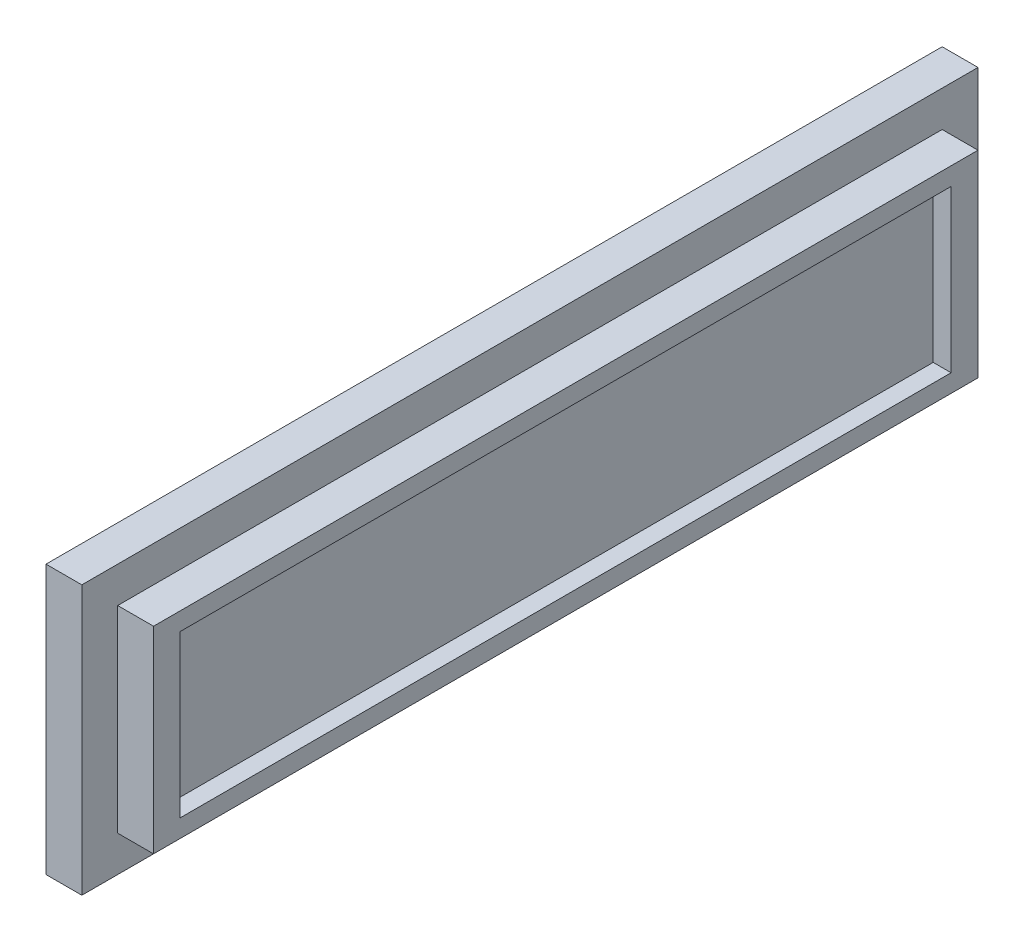
ISO-10303-21;
HEADER;
FILE_DESCRIPTION(('STEP AP214'),'2;1');
FILE_NAME('part.step','',(''),(''),'','','');
FILE_SCHEMA(('AUTOMOTIVE_DESIGN { 1 0 10303 214 1 1 1 1 }'));
ENDSEC;
DATA;
#1=APPLICATION_CONTEXT('core data for automotive mechanical design processes');
#2=APPLICATION_PROTOCOL_DEFINITION('international standard','automotive_design',2000,#1);
#3=PRODUCT_CONTEXT('',#1,'mechanical');
#4=PRODUCT('Part','Part','',(#3));
#5=PRODUCT_RELATED_PRODUCT_CATEGORY('part','',(#4));
#6=PRODUCT_DEFINITION_FORMATION('','',#4);
#7=PRODUCT_DEFINITION_CONTEXT('part definition',#1,'design');
#8=PRODUCT_DEFINITION('design','',#6,#7);
#9=PRODUCT_DEFINITION_SHAPE('','',#8);
#10=(LENGTH_UNIT() NAMED_UNIT(*) SI_UNIT(.MILLI.,.METRE.));
#11=(NAMED_UNIT(*) PLANE_ANGLE_UNIT() SI_UNIT($,.RADIAN.));
#12=(NAMED_UNIT(*) SI_UNIT($,.STERADIAN.) SOLID_ANGLE_UNIT());
#13=UNCERTAINTY_MEASURE_WITH_UNIT(LENGTH_MEASURE(1.E-05),#10,'distance_accuracy_value','');
#14=(GEOMETRIC_REPRESENTATION_CONTEXT(3) GLOBAL_UNCERTAINTY_ASSIGNED_CONTEXT((#13)) GLOBAL_UNIT_ASSIGNED_CONTEXT((#10,
#11,#12)) REPRESENTATION_CONTEXT('',''));
#15=CARTESIAN_POINT('',(0.,0.,0.));
#16=DIRECTION('',(0.,0.,1.));
#17=DIRECTION('',(1.,0.,0.));
#18=AXIS2_PLACEMENT_3D('',#15,#16,#17);
#19=CARTESIAN_POINT('',(2.,4.01459854014599,28.9233576642336));
#20=DIRECTION('',(0.,0.,-1.));
#21=DIRECTION('',(-1.,0.,0.));
#22=AXIS2_PLACEMENT_3D('',#19,#20,#21);
#23=PLANE('',#22);
#24=DIRECTION('',(0.,-1.,0.));
#25=VECTOR('',#24,1.);
#26=CARTESIAN_POINT('',(0.,4.01459854014599,28.9233576642336));
#27=LINE('',#26,#25);
#28=CARTESIAN_POINT('',(0.,4.01459854014599,28.9233576642336));
#29=VERTEX_POINT('',#28);
#30=CARTESIAN_POINT('',(0.,-10.985401459854,28.9233576642336));
#31=VERTEX_POINT('',#30);
#32=EDGE_CURVE('E220',#29,#31,#27,.T.);
#33=ORIENTED_EDGE('',*,*,#32,.T.);
#34=DIRECTION('',(-1.,0.,0.));
#35=VECTOR('',#34,1.);
#36=CARTESIAN_POINT('',(2.,-10.985401459854,28.9233576642336));
#37=LINE('',#36,#35);
#38=CARTESIAN_POINT('',(2.,-10.985401459854,28.9233576642336));
#39=VERTEX_POINT('',#38);
#40=EDGE_CURVE('E11',#39,#31,#37,.T.);
#41=ORIENTED_EDGE('',*,*,#40,.F.);
#42=DIRECTION('',(0.,-1.,0.));
#43=VECTOR('',#42,1.);
#44=CARTESIAN_POINT('',(2.,4.01459854014599,28.9233576642336));
#45=LINE('',#44,#43);
#46=CARTESIAN_POINT('',(2.,4.01459854014599,28.9233576642336));
#47=VERTEX_POINT('',#46);
#48=EDGE_CURVE('E221',#47,#39,#45,.T.);
#49=ORIENTED_EDGE('',*,*,#48,.F.);
#50=DIRECTION('',(-1.,0.,0.));
#51=VECTOR('',#50,1.);
#52=CARTESIAN_POINT('',(2.,4.01459854014599,28.9233576642336));
#53=LINE('',#52,#51);
#54=EDGE_CURVE('E235',#47,#29,#53,.T.);
#55=ORIENTED_EDGE('',*,*,#54,.T.);
#56=EDGE_LOOP('',(#33,#41,#49,#55));
#57=FACE_BOUND('',#56,.T.);
#58=ADVANCED_FACE('F39',(#57),#23,.F.);
#59=CARTESIAN_POINT('',(2.,-10.985401459854,28.9233576642336));
#60=DIRECTION('',(0.,1.,0.));
#61=DIRECTION('',(0.,0.,1.));
#62=AXIS2_PLACEMENT_3D('',#59,#60,#61);
#63=PLANE('',#62);
#64=DIRECTION('',(0.,0.,-1.));
#65=VECTOR('',#64,1.);
#66=CARTESIAN_POINT('',(0.,-10.985401459854,28.9233576642336));
#67=LINE('',#66,#65);
#68=CARTESIAN_POINT('',(0.,-10.985401459854,-21.0766423357664));
#69=VERTEX_POINT('',#68);
#70=EDGE_CURVE('E239',#31,#69,#67,.T.);
#71=ORIENTED_EDGE('',*,*,#70,.T.);
#72=DIRECTION('',(-1.,0.,0.));
#73=VECTOR('',#72,1.);
#74=CARTESIAN_POINT('',(2.,-10.985401459854,-21.0766423357664));
#75=LINE('',#74,#73);
#76=CARTESIAN_POINT('',(2.,-10.985401459854,-21.0766423357664));
#77=VERTEX_POINT('',#76);
#78=EDGE_CURVE('E47',#77,#69,#75,.T.);
#79=ORIENTED_EDGE('',*,*,#78,.F.);
#80=DIRECTION('',(0.,0.,-1.));
#81=VECTOR('',#80,1.);
#82=CARTESIAN_POINT('',(2.,-10.985401459854,28.9233576642336));
#83=LINE('',#82,#81);
#84=EDGE_CURVE('E225',#39,#77,#83,.T.);
#85=ORIENTED_EDGE('',*,*,#84,.F.);
#86=ORIENTED_EDGE('',*,*,#40,.T.);
#87=EDGE_LOOP('',(#71,#79,#85,#86));
#88=FACE_BOUND('',#87,.T.);
#89=ADVANCED_FACE('F275',(#88),#63,.F.);
#90=CARTESIAN_POINT('',(2.,4.01459854014599,-21.0766423357664));
#91=DIRECTION('',(0.,0.,1.));
#92=DIRECTION('',(1.,0.,0.));
#93=AXIS2_PLACEMENT_3D('',#90,#91,#92);
#94=PLANE('',#93);
#95=DIRECTION('',(0.,1.,0.));
#96=VECTOR('',#95,1.);
#97=CARTESIAN_POINT('',(0.,4.01459854014599,-21.0766423357664));
#98=LINE('',#97,#96);
#99=CARTESIAN_POINT('',(0.,4.01459854014599,-21.0766423357664));
#100=VERTEX_POINT('',#99);
#101=EDGE_CURVE('E242',#69,#100,#98,.T.);
#102=ORIENTED_EDGE('',*,*,#101,.T.);
#103=DIRECTION('',(-1.,0.,0.));
#104=VECTOR('',#103,1.);
#105=CARTESIAN_POINT('',(2.,4.01459854014599,-21.0766423357664));
#106=LINE('',#105,#104);
#107=CARTESIAN_POINT('',(2.,4.01459854014599,-21.0766423357664));
#108=VERTEX_POINT('',#107);
#109=EDGE_CURVE('E250',#108,#100,#106,.T.);
#110=ORIENTED_EDGE('',*,*,#109,.F.);
#111=DIRECTION('',(0.,1.,0.));
#112=VECTOR('',#111,1.);
#113=CARTESIAN_POINT('',(2.,4.01459854014599,-21.0766423357664));
#114=LINE('',#113,#112);
#115=EDGE_CURVE('E229',#77,#108,#114,.T.);
#116=ORIENTED_EDGE('',*,*,#115,.F.);
#117=ORIENTED_EDGE('',*,*,#78,.T.);
#118=EDGE_LOOP('',(#102,#110,#116,#117));
#119=FACE_BOUND('',#118,.T.);
#120=ADVANCED_FACE('F259',(#119),#94,.F.);
#121=CARTESIAN_POINT('',(2.,4.01459854014599,28.9233576642336));
#122=DIRECTION('',(0.,-1.,0.));
#123=DIRECTION('',(0.,0.,-1.));
#124=AXIS2_PLACEMENT_3D('',#121,#122,#123);
#125=PLANE('',#124);
#126=DIRECTION('',(0.,0.,1.));
#127=VECTOR('',#126,1.);
#128=CARTESIAN_POINT('',(0.,4.01459854014599,28.9233576642336));
#129=LINE('',#128,#127);
#130=EDGE_CURVE('E226',#100,#29,#129,.T.);
#131=ORIENTED_EDGE('',*,*,#130,.T.);
#132=ORIENTED_EDGE('',*,*,#54,.F.);
#133=DIRECTION('',(0.,0.,1.));
#134=VECTOR('',#133,1.);
#135=CARTESIAN_POINT('',(2.,4.01459854014599,28.9233576642336));
#136=LINE('',#135,#134);
#137=EDGE_CURVE('E232',#108,#47,#136,.T.);
#138=ORIENTED_EDGE('',*,*,#137,.F.);
#139=ORIENTED_EDGE('',*,*,#109,.T.);
#140=EDGE_LOOP('',(#131,#132,#138,#139));
#141=FACE_BOUND('',#140,.T.);
#142=ADVANCED_FACE('F268',(#141),#125,.F.);
#143=CARTESIAN_POINT('',(2.,0.,0.));
#144=DIRECTION('',(1.,0.,0.));
#145=DIRECTION('',(0.,0.,-1.));
#146=AXIS2_PLACEMENT_3D('',#143,#144,#145);
#147=PLANE('',#146);
#148=DIRECTION('',(0.,-1.,0.));
#149=VECTOR('',#148,1.);
#150=CARTESIAN_POINT('',(2.,2.01459854014599,26.9233576642336));
#151=LINE('',#150,#149);
#152=CARTESIAN_POINT('',(2.,2.01459854014599,26.9233576642336));
#153=VERTEX_POINT('',#152);
#154=CARTESIAN_POINT('',(2.,-8.98540145985401,26.9233576642336));
#155=VERTEX_POINT('',#154);
#156=EDGE_CURVE('E62',#153,#155,#151,.T.);
#157=ORIENTED_EDGE('',*,*,#156,.F.);
#158=DIRECTION('',(0.,0.,1.));
#159=VECTOR('',#158,1.);
#160=CARTESIAN_POINT('',(2.,2.01459854014599,26.9233576642336));
#161=LINE('',#160,#159);
#162=CARTESIAN_POINT('',(2.,2.01459854014599,-19.0766423357664));
#163=VERTEX_POINT('',#162);
#164=EDGE_CURVE('E183',#163,#153,#161,.T.);
#165=ORIENTED_EDGE('',*,*,#164,.F.);
#166=DIRECTION('',(0.,1.,0.));
#167=VECTOR('',#166,1.);
#168=CARTESIAN_POINT('',(2.,2.01459854014599,-19.0766423357664));
#169=LINE('',#168,#167);
#170=CARTESIAN_POINT('',(2.,-8.98540145985401,-19.0766423357664));
#171=VERTEX_POINT('',#170);
#172=EDGE_CURVE('E199',#171,#163,#169,.T.);
#173=ORIENTED_EDGE('',*,*,#172,.F.);
#174=DIRECTION('',(0.,0.,-1.));
#175=VECTOR('',#174,1.);
#176=CARTESIAN_POINT('',(2.,-8.98540145985401,26.9233576642336));
#177=LINE('',#176,#175);
#178=EDGE_CURVE('E195',#155,#171,#177,.T.);
#179=ORIENTED_EDGE('',*,*,#178,.F.);
#180=EDGE_LOOP('',(#157,#165,#173,#179));
#181=FACE_BOUND('',#180,.T.);
#182=ORIENTED_EDGE('',*,*,#48,.T.);
#183=ORIENTED_EDGE('',*,*,#84,.T.);
#184=ORIENTED_EDGE('',*,*,#115,.T.);
#185=ORIENTED_EDGE('',*,*,#137,.T.);
#186=EDGE_LOOP('',(#182,#183,#184,#185));
#187=FACE_BOUND('',#186,.T.);
#188=ADVANCED_FACE('F274',(#181,#187),#147,.T.);
#189=CARTESIAN_POINT('',(0.,0.,0.));
#190=DIRECTION('',(1.,0.,0.));
#191=DIRECTION('',(0.,0.,-1.));
#192=AXIS2_PLACEMENT_3D('',#189,#190,#191);
#193=PLANE('',#192);
#194=ORIENTED_EDGE('',*,*,#32,.F.);
#195=ORIENTED_EDGE('',*,*,#130,.F.);
#196=ORIENTED_EDGE('',*,*,#101,.F.);
#197=ORIENTED_EDGE('',*,*,#70,.F.);
#198=EDGE_LOOP('',(#194,#195,#196,#197));
#199=FACE_BOUND('',#198,.T.);
#200=ADVANCED_FACE('F265',(#199),#193,.F.);
#201=CARTESIAN_POINT('',(4.,2.01459854014599,26.9233576642336));
#202=DIRECTION('',(0.,0.,-1.));
#203=DIRECTION('',(-1.,0.,0.));
#204=AXIS2_PLACEMENT_3D('',#201,#202,#203);
#205=PLANE('',#204);
#206=ORIENTED_EDGE('',*,*,#156,.T.);
#207=DIRECTION('',(-1.,0.,0.));
#208=VECTOR('',#207,1.);
#209=CARTESIAN_POINT('',(4.,-8.98540145985401,26.9233576642336));
#210=LINE('',#209,#208);
#211=CARTESIAN_POINT('',(4.,-8.98540145985401,26.9233576642336));
#212=VERTEX_POINT('',#211);
#213=EDGE_CURVE('E216',#212,#155,#210,.T.);
#214=ORIENTED_EDGE('',*,*,#213,.F.);
#215=DIRECTION('',(0.,-1.,0.));
#216=VECTOR('',#215,1.);
#217=CARTESIAN_POINT('',(4.,2.01459854014599,26.9233576642336));
#218=LINE('',#217,#216);
#219=CARTESIAN_POINT('',(4.,2.01459854014599,26.9233576642336));
#220=VERTEX_POINT('',#219);
#221=EDGE_CURVE('E178',#220,#212,#218,.T.);
#222=ORIENTED_EDGE('',*,*,#221,.F.);
#223=DIRECTION('',(-1.,0.,0.));
#224=VECTOR('',#223,1.);
#225=CARTESIAN_POINT('',(4.,2.01459854014599,26.9233576642336));
#226=LINE('',#225,#224);
#227=EDGE_CURVE('E192',#220,#153,#226,.T.);
#228=ORIENTED_EDGE('',*,*,#227,.T.);
#229=EDGE_LOOP('',(#206,#214,#222,#228));
#230=FACE_BOUND('',#229,.T.);
#231=ADVANCED_FACE('F287',(#230),#205,.F.);
#232=CARTESIAN_POINT('',(4.,-8.98540145985401,26.9233576642336));
#233=DIRECTION('',(0.,1.,0.));
#234=DIRECTION('',(0.,0.,1.));
#235=AXIS2_PLACEMENT_3D('',#232,#233,#234);
#236=PLANE('',#235);
#237=ORIENTED_EDGE('',*,*,#178,.T.);
#238=DIRECTION('',(-1.,0.,0.));
#239=VECTOR('',#238,1.);
#240=CARTESIAN_POINT('',(4.,-8.98540145985401,-19.0766423357664));
#241=LINE('',#240,#239);
#242=CARTESIAN_POINT('',(4.,-8.98540145985401,-19.0766423357664));
#243=VERTEX_POINT('',#242);
#244=EDGE_CURVE('E212',#243,#171,#241,.T.);
#245=ORIENTED_EDGE('',*,*,#244,.F.);
#246=DIRECTION('',(0.,0.,-1.));
#247=VECTOR('',#246,1.);
#248=CARTESIAN_POINT('',(4.,-8.98540145985401,26.9233576642336));
#249=LINE('',#248,#247);
#250=EDGE_CURVE('E182',#212,#243,#249,.T.);
#251=ORIENTED_EDGE('',*,*,#250,.F.);
#252=ORIENTED_EDGE('',*,*,#213,.T.);
#253=EDGE_LOOP('',(#237,#245,#251,#252));
#254=FACE_BOUND('',#253,.T.);
#255=ADVANCED_FACE('F292',(#254),#236,.F.);
#256=CARTESIAN_POINT('',(4.,2.01459854014599,-19.0766423357664));
#257=DIRECTION('',(0.,0.,1.));
#258=DIRECTION('',(1.,0.,0.));
#259=AXIS2_PLACEMENT_3D('',#256,#257,#258);
#260=PLANE('',#259);
#261=ORIENTED_EDGE('',*,*,#172,.T.);
#262=DIRECTION('',(-1.,0.,0.));
#263=VECTOR('',#262,1.);
#264=CARTESIAN_POINT('',(4.,2.01459854014599,-19.0766423357664));
#265=LINE('',#264,#263);
#266=CARTESIAN_POINT('',(4.,2.01459854014599,-19.0766423357664));
#267=VERTEX_POINT('',#266);
#268=EDGE_CURVE('E208',#267,#163,#265,.T.);
#269=ORIENTED_EDGE('',*,*,#268,.F.);
#270=DIRECTION('',(0.,1.,0.));
#271=VECTOR('',#270,1.);
#272=CARTESIAN_POINT('',(4.,2.01459854014599,-19.0766423357664));
#273=LINE('',#272,#271);
#274=EDGE_CURVE('E186',#243,#267,#273,.T.);
#275=ORIENTED_EDGE('',*,*,#274,.F.);
#276=ORIENTED_EDGE('',*,*,#244,.T.);
#277=EDGE_LOOP('',(#261,#269,#275,#276));
#278=FACE_BOUND('',#277,.T.);
#279=ADVANCED_FACE('F296',(#278),#260,.F.);
#280=CARTESIAN_POINT('',(4.,2.01459854014599,26.9233576642336));
#281=DIRECTION('',(0.,-1.,0.));
#282=DIRECTION('',(0.,0.,-1.));
#283=AXIS2_PLACEMENT_3D('',#280,#281,#282);
#284=PLANE('',#283);
#285=ORIENTED_EDGE('',*,*,#164,.T.);
#286=ORIENTED_EDGE('',*,*,#227,.F.);
#287=DIRECTION('',(0.,0.,1.));
#288=VECTOR('',#287,1.);
#289=CARTESIAN_POINT('',(4.,2.01459854014599,26.9233576642336));
#290=LINE('',#289,#288);
#291=EDGE_CURVE('E189',#267,#220,#290,.T.);
#292=ORIENTED_EDGE('',*,*,#291,.F.);
#293=ORIENTED_EDGE('',*,*,#268,.T.);
#294=EDGE_LOOP('',(#285,#286,#292,#293));
#295=FACE_BOUND('',#294,.T.);
#296=ADVANCED_FACE('F300',(#295),#284,.F.);
#297=CARTESIAN_POINT('',(4.,0.,0.));
#298=DIRECTION('',(1.,0.,0.));
#299=DIRECTION('',(0.,0.,-1.));
#300=AXIS2_PLACEMENT_3D('',#297,#298,#299);
#301=PLANE('',#300);
#302=DIRECTION('',(0.,-1.,0.));
#303=VECTOR('',#302,1.);
#304=CARTESIAN_POINT('',(4.,1.01459854014599,25.4330156481183));
#305=LINE('',#304,#303);
#306=CARTESIAN_POINT('',(4.,1.01459854014599,25.4330156481183));
#307=VERTEX_POINT('',#306);
#308=CARTESIAN_POINT('',(4.,-7.98813042960639,25.4330156481183));
#309=VERTEX_POINT('',#308);
#310=EDGE_CURVE('E54',#307,#309,#305,.T.);
#311=ORIENTED_EDGE('',*,*,#310,.F.);
#312=DIRECTION('',(0.,0.,1.));
#313=VECTOR('',#312,1.);
#314=CARTESIAN_POINT('',(4.,1.01459854014599,25.4330156481183));
#315=LINE('',#314,#313);
#316=CARTESIAN_POINT('',(4.,1.01459854014599,-17.5766423357664));
#317=VERTEX_POINT('',#316);
#318=EDGE_CURVE('E151',#317,#307,#315,.T.);
#319=ORIENTED_EDGE('',*,*,#318,.F.);
#320=DIRECTION('',(0.,1.,0.));
#321=VECTOR('',#320,1.);
#322=CARTESIAN_POINT('',(4.,1.01459854014599,-17.5766423357664));
#323=LINE('',#322,#321);
#324=CARTESIAN_POINT('',(4.,-7.98813042960639,-17.5766423357664));
#325=VERTEX_POINT('',#324);
#326=EDGE_CURVE('E155',#325,#317,#323,.T.);
#327=ORIENTED_EDGE('',*,*,#326,.F.);
#328=DIRECTION('',(0.,0.,-1.));
#329=VECTOR('',#328,1.);
#330=CARTESIAN_POINT('',(4.,-7.98813042960639,25.4330156481183));
#331=LINE('',#330,#329);
#332=EDGE_CURVE('E164',#309,#325,#331,.T.);
#333=ORIENTED_EDGE('',*,*,#332,.F.);
#334=EDGE_LOOP('',(#311,#319,#327,#333));
#335=FACE_BOUND('',#334,.T.);
#336=ORIENTED_EDGE('',*,*,#221,.T.);
#337=ORIENTED_EDGE('',*,*,#250,.T.);
#338=ORIENTED_EDGE('',*,*,#274,.T.);
#339=ORIENTED_EDGE('',*,*,#291,.T.);
#340=EDGE_LOOP('',(#336,#337,#338,#339));
#341=FACE_BOUND('',#340,.T.);
#342=ADVANCED_FACE('F304',(#335,#341),#301,.T.);
#343=CARTESIAN_POINT('',(3.,1.01459854014599,25.4330156481183));
#344=DIRECTION('',(0.,0.,1.));
#345=DIRECTION('',(1.,0.,0.));
#346=AXIS2_PLACEMENT_3D('',#343,#344,#345);
#347=PLANE('',#346);
#348=ORIENTED_EDGE('',*,*,#310,.T.);
#349=DIRECTION('',(1.,0.,0.));
#350=VECTOR('',#349,1.);
#351=CARTESIAN_POINT('',(3.,-7.98813042960639,25.4330156481183));
#352=LINE('',#351,#350);
#353=CARTESIAN_POINT('',(3.,-7.98813042960639,25.4330156481183));
#354=VERTEX_POINT('',#353);
#355=EDGE_CURVE('E126',#354,#309,#352,.T.);
#356=ORIENTED_EDGE('',*,*,#355,.F.);
#357=DIRECTION('',(0.,-1.,0.));
#358=VECTOR('',#357,1.);
#359=CARTESIAN_POINT('',(3.,1.01459854014599,25.4330156481183));
#360=LINE('',#359,#358);
#361=CARTESIAN_POINT('',(3.,1.01459854014599,25.4330156481183));
#362=VERTEX_POINT('',#361);
#363=EDGE_CURVE('E130',#362,#354,#360,.T.);
#364=ORIENTED_EDGE('',*,*,#363,.F.);
#365=DIRECTION('',(1.,0.,0.));
#366=VECTOR('',#365,1.);
#367=CARTESIAN_POINT('',(3.,1.01459854014599,25.4330156481183));
#368=LINE('',#367,#366);
#369=EDGE_CURVE('E170',#362,#307,#368,.T.);
#370=ORIENTED_EDGE('',*,*,#369,.T.);
#371=EDGE_LOOP('',(#348,#356,#364,#370));
#372=FACE_BOUND('',#371,.T.);
#373=ADVANCED_FACE('F128',(#372),#347,.F.);
#374=CARTESIAN_POINT('',(3.,1.01459854014599,25.4330156481183));
#375=DIRECTION('',(0.,1.,0.));
#376=DIRECTION('',(0.,0.,1.));
#377=AXIS2_PLACEMENT_3D('',#374,#375,#376);
#378=PLANE('',#377);
#379=ORIENTED_EDGE('',*,*,#318,.T.);
#380=ORIENTED_EDGE('',*,*,#369,.F.);
#381=DIRECTION('',(0.,0.,1.));
#382=VECTOR('',#381,1.);
#383=CARTESIAN_POINT('',(3.,1.01459854014599,25.4330156481183));
#384=LINE('',#383,#382);
#385=CARTESIAN_POINT('',(3.,1.01459854014599,-17.5766423357664));
#386=VERTEX_POINT('',#385);
#387=EDGE_CURVE('E137',#386,#362,#384,.T.);
#388=ORIENTED_EDGE('',*,*,#387,.F.);
#389=DIRECTION('',(1.,0.,0.));
#390=VECTOR('',#389,1.);
#391=CARTESIAN_POINT('',(3.,1.01459854014599,-17.5766423357664));
#392=LINE('',#391,#390);
#393=EDGE_CURVE('E173',#386,#317,#392,.T.);
#394=ORIENTED_EDGE('',*,*,#393,.T.);
#395=EDGE_LOOP('',(#379,#380,#388,#394));
#396=FACE_BOUND('',#395,.T.);
#397=ADVANCED_FACE('F311',(#396),#378,.F.);
#398=CARTESIAN_POINT('',(3.,1.01459854014599,-17.5766423357664));
#399=DIRECTION('',(0.,0.,-1.));
#400=DIRECTION('',(-1.,0.,0.));
#401=AXIS2_PLACEMENT_3D('',#398,#399,#400);
#402=PLANE('',#401);
#403=ORIENTED_EDGE('',*,*,#326,.T.);
#404=ORIENTED_EDGE('',*,*,#393,.F.);
#405=DIRECTION('',(0.,1.,0.));
#406=VECTOR('',#405,1.);
#407=CARTESIAN_POINT('',(3.,1.01459854014599,-17.5766423357664));
#408=LINE('',#407,#406);
#409=CARTESIAN_POINT('',(3.,-7.98813042960639,-17.5766423357664));
#410=VERTEX_POINT('',#409);
#411=EDGE_CURVE('E146',#410,#386,#408,.T.);
#412=ORIENTED_EDGE('',*,*,#411,.F.);
#413=DIRECTION('',(1.,0.,0.));
#414=VECTOR('',#413,1.);
#415=CARTESIAN_POINT('',(3.,-7.98813042960639,-17.5766423357664));
#416=LINE('',#415,#414);
#417=EDGE_CURVE('E136',#410,#325,#416,.T.);
#418=ORIENTED_EDGE('',*,*,#417,.T.);
#419=EDGE_LOOP('',(#403,#404,#412,#418));
#420=FACE_BOUND('',#419,.T.);
#421=ADVANCED_FACE('F314',(#420),#402,.F.);
#422=CARTESIAN_POINT('',(3.,-7.98813042960639,25.4330156481183));
#423=DIRECTION('',(0.,-1.,0.));
#424=DIRECTION('',(0.,0.,-1.));
#425=AXIS2_PLACEMENT_3D('',#422,#423,#424);
#426=PLANE('',#425);
#427=ORIENTED_EDGE('',*,*,#332,.T.);
#428=ORIENTED_EDGE('',*,*,#417,.F.);
#429=DIRECTION('',(0.,0.,-1.));
#430=VECTOR('',#429,1.);
#431=CARTESIAN_POINT('',(3.,-7.98813042960639,25.4330156481183));
#432=LINE('',#431,#430);
#433=EDGE_CURVE('E140',#354,#410,#432,.T.);
#434=ORIENTED_EDGE('',*,*,#433,.F.);
#435=ORIENTED_EDGE('',*,*,#355,.T.);
#436=EDGE_LOOP('',(#427,#428,#434,#435));
#437=FACE_BOUND('',#436,.T.);
#438=ADVANCED_FACE('F141',(#437),#426,.F.);
#439=CARTESIAN_POINT('',(3.,0.,0.));
#440=DIRECTION('',(1.,0.,0.));
#441=DIRECTION('',(0.,0.,-1.));
#442=AXIS2_PLACEMENT_3D('',#439,#440,#441);
#443=PLANE('',#442);
#444=ORIENTED_EDGE('',*,*,#363,.T.);
#445=ORIENTED_EDGE('',*,*,#433,.T.);
#446=ORIENTED_EDGE('',*,*,#411,.T.);
#447=ORIENTED_EDGE('',*,*,#387,.T.);
#448=EDGE_LOOP('',(#444,#445,#446,#447));
#449=FACE_BOUND('',#448,.T.);
#450=ADVANCED_FACE('F148',(#449),#443,.T.);
#451=CLOSED_SHELL('',(#58,#89,#120,#142,#188,#200,#231,#255,#279,#296,#342,#373,#397,#421,#438,#450));
#452=MANIFOLD_SOLID_BREP('B2',#451);
#453=ADVANCED_BREP_SHAPE_REPRESENTATION('',(#18,#452),#14);
#454=SHAPE_DEFINITION_REPRESENTATION(#9,#453);
ENDSEC;
END-ISO-10303-21;
